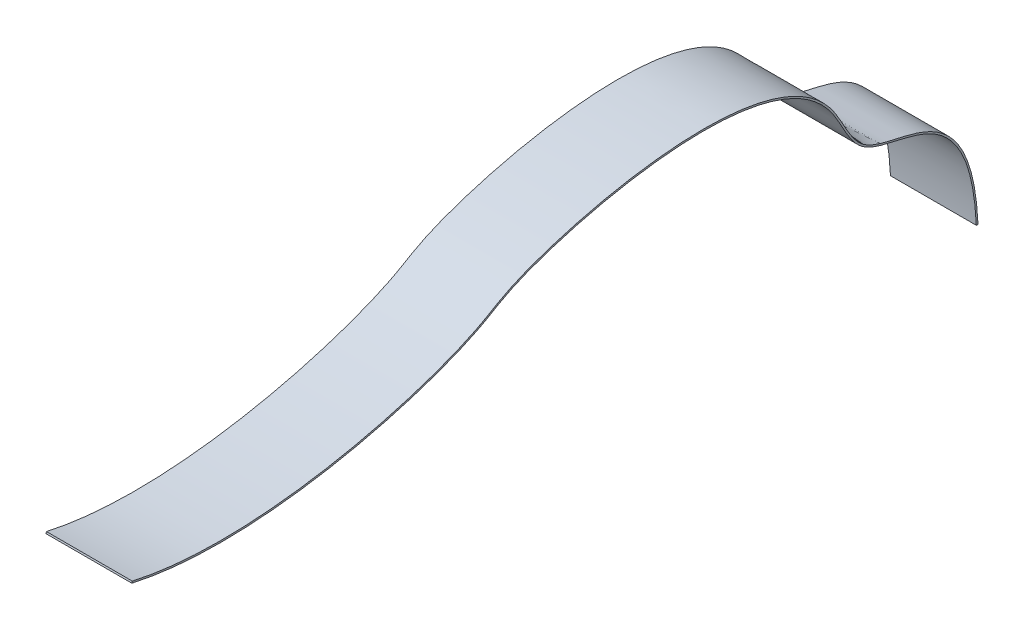
ISO-10303-21;
HEADER;
FILE_DESCRIPTION(('STEP AP214'),'2;1');
FILE_NAME('part.step','',(''),(''),'','','');
FILE_SCHEMA(('AUTOMOTIVE_DESIGN { 1 0 10303 214 1 1 1 1 }'));
ENDSEC;
DATA;
#1=APPLICATION_CONTEXT('core data for automotive mechanical design processes');
#2=APPLICATION_PROTOCOL_DEFINITION('international standard','automotive_design',2000,#1);
#3=PRODUCT_CONTEXT('',#1,'mechanical');
#4=PRODUCT('Part','Part','',(#3));
#5=PRODUCT_RELATED_PRODUCT_CATEGORY('part','',(#4));
#6=PRODUCT_DEFINITION_FORMATION('','',#4);
#7=PRODUCT_DEFINITION_CONTEXT('part definition',#1,'design');
#8=PRODUCT_DEFINITION('design','',#6,#7);
#9=PRODUCT_DEFINITION_SHAPE('','',#8);
#10=(LENGTH_UNIT() NAMED_UNIT(*) SI_UNIT(.MILLI.,.METRE.));
#11=(NAMED_UNIT(*) PLANE_ANGLE_UNIT() SI_UNIT($,.RADIAN.));
#12=(NAMED_UNIT(*) SI_UNIT($,.STERADIAN.) SOLID_ANGLE_UNIT());
#13=UNCERTAINTY_MEASURE_WITH_UNIT(LENGTH_MEASURE(1.E-05),#10,'distance_accuracy_value','');
#14=(GEOMETRIC_REPRESENTATION_CONTEXT(3) GLOBAL_UNCERTAINTY_ASSIGNED_CONTEXT((#13)) GLOBAL_UNIT_ASSIGNED_CONTEXT((#10,
#11,#12)) REPRESENTATION_CONTEXT('',''));
#15=CARTESIAN_POINT('',(0.,0.,0.));
#16=DIRECTION('',(0.,0.,1.));
#17=DIRECTION('',(1.,0.,0.));
#18=AXIS2_PLACEMENT_3D('',#15,#16,#17);
#19=CARTESIAN_POINT('',(0.,0.,0.));
#20=DIRECTION('',(0.,1.,0.));
#21=DIRECTION('',(0.,0.,1.));
#22=AXIS2_PLACEMENT_3D('',#19,#20,#21);
#23=PLANE('',#22);
#24=DIRECTION('',(0.,0.,1.));
#25=VECTOR('',#24,1.);
#26=CARTESIAN_POINT('',(-3.05,0.,-0.120000000000001));
#27=LINE('',#26,#25);
#28=CARTESIAN_POINT('',(-3.05,0.,-0.120000000000001));
#29=VERTEX_POINT('',#28);
#30=CARTESIAN_POINT('',(-3.05,0.,0.));
#31=VERTEX_POINT('',#30);
#32=EDGE_CURVE('E70',#29,#31,#27,.T.);
#33=ORIENTED_EDGE('',*,*,#32,.F.);
#34=DIRECTION('',(-1.,0.,0.));
#35=VECTOR('',#34,1.);
#36=CARTESIAN_POINT('',(-3.05,0.,-0.120000000000001));
#37=LINE('',#36,#35);
#38=CARTESIAN_POINT('',(3.05,0.,-0.120000000000001));
#39=VERTEX_POINT('',#38);
#40=EDGE_CURVE('E72',#39,#29,#37,.T.);
#41=ORIENTED_EDGE('',*,*,#40,.F.);
#42=DIRECTION('',(0.,0.,-1.));
#43=VECTOR('',#42,1.);
#44=CARTESIAN_POINT('',(3.05,0.,-0.120000000000001));
#45=LINE('',#44,#43);
#46=CARTESIAN_POINT('',(3.05,0.,0.));
#47=VERTEX_POINT('',#46);
#48=EDGE_CURVE('E86',#47,#39,#45,.T.);
#49=ORIENTED_EDGE('',*,*,#48,.F.);
#50=DIRECTION('',(1.,0.,0.));
#51=VECTOR('',#50,1.);
#52=CARTESIAN_POINT('',(-3.05,0.,0.));
#53=LINE('',#52,#51);
#54=EDGE_CURVE('E68',#31,#47,#53,.T.);
#55=ORIENTED_EDGE('',*,*,#54,.F.);
#56=EDGE_LOOP('',(#33,#41,#49,#55));
#57=FACE_BOUND('',#56,.T.);
#58=ADVANCED_FACE('F32',(#57),#23,.F.);
#59=CARTESIAN_POINT('',(0.,7.97634867030642,60.));
#60=DIRECTION('',(0.,0.266271074609221,0.963898186960869));
#61=DIRECTION('',(0.,-0.963898186960869,0.266271074609221));
#62=AXIS2_PLACEMENT_3D('',#59,#60,#61);
#63=PLANE('',#62);
#64=DIRECTION('',(0.,-0.963898186960869,0.266271074609221));
#65=VECTOR('',#64,1.);
#66=CARTESIAN_POINT('',(-3.05,8.09201645274173,59.9680474710469));
#67=LINE('',#66,#65);
#68=CARTESIAN_POINT('',(-3.05,8.09201645274173,59.9680474710469));
#69=VERTEX_POINT('',#68);
#70=CARTESIAN_POINT('',(-3.05,7.97634867030642,60.));
#71=VERTEX_POINT('',#70);
#72=EDGE_CURVE('E90',#69,#71,#67,.T.);
#73=ORIENTED_EDGE('',*,*,#72,.T.);
#74=DIRECTION('',(1.,0.,0.));
#75=VECTOR('',#74,1.);
#76=CARTESIAN_POINT('',(-3.05,7.97634867030642,60.));
#77=LINE('',#76,#75);
#78=CARTESIAN_POINT('',(3.05,7.97634867030642,60.));
#79=VERTEX_POINT('',#78);
#80=EDGE_CURVE('E158',#71,#79,#77,.T.);
#81=ORIENTED_EDGE('',*,*,#80,.T.);
#82=DIRECTION('',(0.,0.963898186960869,-0.266271074609221));
#83=VECTOR('',#82,1.);
#84=CARTESIAN_POINT('',(3.05,8.09201645274173,59.9680474710469));
#85=LINE('',#84,#83);
#86=CARTESIAN_POINT('',(3.05,8.09201645274173,59.9680474710469));
#87=VERTEX_POINT('',#86);
#88=EDGE_CURVE('E42',#79,#87,#85,.T.);
#89=ORIENTED_EDGE('',*,*,#88,.T.);
#90=DIRECTION('',(-1.,0.,0.));
#91=VECTOR('',#90,1.);
#92=CARTESIAN_POINT('',(-3.05,8.09201645274173,59.9680474710469));
#93=LINE('',#92,#91);
#94=EDGE_CURVE('E11',#87,#69,#93,.T.);
#95=ORIENTED_EDGE('',*,*,#94,.T.);
#96=EDGE_LOOP('',(#73,#81,#89,#95));
#97=FACE_BOUND('',#96,.T.);
#98=ADVANCED_FACE('F146',(#97),#63,.T.);
#99=CARTESIAN_POINT('',(-3.05,0.,-0.120000000000001));
#100=DIRECTION('',(-1.,0.,0.));
#101=DIRECTION('',(0.,0.,1.));
#102=AXIS2_PLACEMENT_3D('',#99,#100,#101);
#103=PLANE('',#102);
#104=CARTESIAN_POINT('',(-3.05,0.,0.));
#105=CARTESIAN_POINT('',(-3.05,8.48120396040808,0.389810136206408));
#106=CARTESIAN_POINT('',(-3.05,7.45861924469704,4.8196854441271));
#107=CARTESIAN_POINT('',(-3.05,8.6508489245226,7.72277395023314));
#108=CARTESIAN_POINT('',(-3.05,8.8166128288052,8.01594073097296));
#109=CARTESIAN_POINT('',(-3.05,9.25519468529611,8.52365116968327));
#110=CARTESIAN_POINT('',(-3.05,9.52339225487259,8.74126046181841));
#111=CARTESIAN_POINT('',(-3.05,10.4092525897436,9.33931371640342));
#112=CARTESIAN_POINT('',(-3.05,11.1081830978846,9.66498296081222));
#113=CARTESIAN_POINT('',(-3.05,12.057305474226,10.2597897669768));
#114=CARTESIAN_POINT('',(-3.05,12.3537037861907,10.4787823840159));
#115=CARTESIAN_POINT('',(-3.05,12.8979009484752,10.9635252047044));
#116=CARTESIAN_POINT('',(-3.05,13.1473334645292,11.2278435449592));
#117=CARTESIAN_POINT('',(-3.05,13.8316981660934,12.0796721171958));
#118=CARTESIAN_POINT('',(-3.05,14.2026974982701,12.7260559121902));
#119=CARTESIAN_POINT('',(-3.05,16.8720655116809,19.0827792837767));
#120=CARTESIAN_POINT('',(-3.05,14.4830522006781,28.5680036492555));
#121=CARTESIAN_POINT('',(-3.05,12.4827379757237,33.3273050952866));
#122=CARTESIAN_POINT('',(-3.05,12.1369678504192,33.9050643826275));
#123=CARTESIAN_POINT('',(-3.05,11.6218002696872,34.7889133199316));
#124=CARTESIAN_POINT('',(-3.05,11.4502776944944,35.0884995169633));
#125=CARTESIAN_POINT('',(-3.05,11.0966533935646,35.7821094575561));
#126=CARTESIAN_POINT('',(-3.05,10.9157630210769,36.1691506383084));
#127=CARTESIAN_POINT('',(-3.05,10.0038154099989,38.284234755494));
#128=CARTESIAN_POINT('',(-3.05,9.25027089654004,40.5519123800001));
#129=CARTESIAN_POINT('',(-3.05,7.41285936542026,48.2637482212632));
#130=CARTESIAN_POINT('',(-3.05,6.7522143439112,54.6167094357728));
#131=CARTESIAN_POINT('',(-3.05,7.97634867030642,60.));
#132=B_SPLINE_CURVE_WITH_KNOTS('',3,(#104,#105,#106,#107,#108,#109,#110,#111,#112,#113,#114,
#115,#116,#117,#118,#119,#120,#121,#122,#123,#124,#125,#126,#127,#128,#129,#130,#131),
.UNSPECIFIED.,.F.,.F.,(4,2,2,2,2,2,2,2,2,2,2,2,2,4),(0.,0.125,0.140625,0.15625,0.1875,0.203125,
0.21875,0.25,0.5,0.5625,0.59375,0.625,0.75,1.),.UNSPECIFIED.);
#133=EDGE_CURVE('E35',#31,#71,#132,.T.);
#134=ORIENTED_EDGE('',*,*,#133,.T.);
#135=ORIENTED_EDGE('',*,*,#72,.F.);
#136=CARTESIAN_POINT('',(-3.05,0.,-0.120000000000001));
#137=CARTESIAN_POINT('',(-3.05,2.35907945007418,-0.0121088808887355));
#138=CARTESIAN_POINT('',(-3.05,3.99697240192662,0.406650247024757));
#139=CARTESIAN_POINT('',(-3.05,6.31476004554354,1.63182057530954));
#140=CARTESIAN_POINT('',(-3.05,6.99137930185127,2.44124964021302));
#141=CARTESIAN_POINT('',(-3.05,7.84636709665277,4.16997760321309));
#142=CARTESIAN_POINT('',(-3.05,8.02880758755432,5.08689616191275));
#143=CARTESIAN_POINT('',(-3.05,8.31312929136114,6.34544318038815));
#144=CARTESIAN_POINT('',(-3.05,8.40952531147873,6.74556565628542));
#145=CARTESIAN_POINT('',(-3.05,8.66391444816968,7.47448943246688));
#146=CARTESIAN_POINT('',(-3.05,8.82159612107124,7.80276776708872));
#147=CARTESIAN_POINT('',(-3.05,9.3753176796599,8.51999380842043));
#148=CARTESIAN_POINT('',(-3.05,9.87200734447321,8.85557685292436));
#149=CARTESIAN_POINT('',(-3.05,10.9700654323135,9.48831825516512));
#150=CARTESIAN_POINT('',(-3.05,11.5694383421883,9.78513000931942));
#151=CARTESIAN_POINT('',(-3.05,12.8723531880958,10.691947581963));
#152=CARTESIAN_POINT('',(-3.05,13.4916110298304,11.3734605345555));
#153=CARTESIAN_POINT('',(-3.05,14.4737023304396,12.9534084108431));
#154=CARTESIAN_POINT('',(-3.05,14.8369476791241,13.8517306254131));
#155=CARTESIAN_POINT('',(-3.05,15.6106917485068,16.762658600662));
#156=CARTESIAN_POINT('',(-3.05,15.7061210328681,18.9918056711895));
#157=CARTESIAN_POINT('',(-3.05,15.3977900348541,23.4686061808669));
#158=CARTESIAN_POINT('',(-3.05,14.9934538547083,25.7163189879491));
#159=CARTESIAN_POINT('',(-3.05,14.0158971875026,29.6687946702095));
#160=CARTESIAN_POINT('',(-3.05,13.4430322561571,31.3727247252303));
#161=CARTESIAN_POINT('',(-3.05,12.6788786823213,33.157115515302));
#162=CARTESIAN_POINT('',(-3.05,12.432390149322,33.6226967323121));
#163=CARTESIAN_POINT('',(-3.05,11.9576696031105,34.4580656316045));
#164=CARTESIAN_POINT('',(-3.05,11.7301011113735,34.8271362343689));
#165=CARTESIAN_POINT('',(-3.05,10.9217987099977,36.3473339345063));
#166=CARTESIAN_POINT('',(-3.05,10.2946785699131,37.8793543411509));
#167=CARTESIAN_POINT('',(-3.05,9.12539009948058,41.5341697302077));
#168=CARTESIAN_POINT('',(-3.05,8.5827394809645,43.6575201306895));
#169=CARTESIAN_POINT('',(-3.05,7.36036086740564,50.4512367782197));
#170=CARTESIAN_POINT('',(-3.05,7.08749715075393,55.5454551092391));
#171=CARTESIAN_POINT('',(-3.05,8.09201645274173,59.9680474710469));
#172=B_SPLINE_CURVE_WITH_KNOTS('',3,(#136,#137,#138,#139,#140,#141,#142,#143,#144,#145,#146,
#147,#148,#149,#150,#151,#152,#153,#154,#155,#156,#157,#158,#159,#160,#161,#162,#163,#164,#165,
#166,#167,#168,#169,#170,#171),.UNSPECIFIED.,.F.,.F.,(4,2,2,2,2,2,2,2,2,2,2,2,2,2,2,2,2,4),(0.,
0.0346061534011105,0.069212306802221,0.103818460203331,0.121121536903887,0.138424613604442,
0.165482677346169,0.192540741087896,0.231276355948661,0.270011970809427,0.347483200530959,
0.42495443025249,0.502425659974022,0.544735403662811,0.587045147351601,0.690283860513701,
0.7935225736758,1.),.UNSPECIFIED.);
#173=EDGE_CURVE('E83',#29,#69,#172,.T.);
#174=ORIENTED_EDGE('',*,*,#173,.F.);
#175=ORIENTED_EDGE('',*,*,#32,.T.);
#176=EDGE_LOOP('',(#134,#135,#174,#175));
#177=FACE_BOUND('',#176,.T.);
#178=ADVANCED_FACE('F89',(#177),#103,.T.);
#179=CARTESIAN_POINT('',(-3.05,0.,0.));
#180=CARTESIAN_POINT('',(-3.05,2.34801475509212,0.107918634638409));
#181=CARTESIAN_POINT('',(-3.05,3.96760692345137,0.52549006052892));
#182=CARTESIAN_POINT('',(-3.05,6.2416441472875,1.73000050151414));
#183=CARTESIAN_POINT('',(-3.05,6.89608916660134,2.51693953097672));
#184=CARTESIAN_POINT('',(-3.05,7.73153011824309,4.21024717133516));
#185=CARTESIAN_POINT('',(-3.05,7.91252599196099,5.11661581202239));
#186=CARTESIAN_POINT('',(-3.05,8.19770650339806,6.37828746100801));
#187=CARTESIAN_POINT('',(-3.05,8.29504776245036,6.78253113968162));
#188=CARTESIAN_POINT('',(-3.05,8.55575478881804,7.52714913216537));
#189=CARTESIAN_POINT('',(-3.05,8.71912052060181,7.86752346277342));
#190=CARTESIAN_POINT('',(-3.05,9.30137642614317,8.61824336626388));
#191=CARTESIAN_POINT('',(-3.05,9.8124001247043,8.9598526220311));
#192=CARTESIAN_POINT('',(-3.05,10.9195996819129,9.59731213049488));
#193=CARTESIAN_POINT('',(-3.05,11.5157755862597,9.89316234375321));
#194=CARTESIAN_POINT('',(-3.05,12.7934489618364,10.7840503507918));
#195=CARTESIAN_POINT('',(-3.05,13.4007277374011,11.4531057628088));
#196=CARTESIAN_POINT('',(-3.05,14.366691523637,13.0095495054989));
#197=CARTESIAN_POINT('',(-3.05,14.725376536757,13.8969378385008));
#198=CARTESIAN_POINT('',(-3.05,15.4904805455413,16.7804494538605));
#199=CARTESIAN_POINT('',(-3.05,15.5859484964915,18.9979193768355));
#200=CARTESIAN_POINT('',(-3.05,15.2780261413134,23.456968925773));
#201=CARTESIAN_POINT('',(-3.05,14.8746358272554,25.6985485653642));
#202=CARTESIAN_POINT('',(-3.05,13.8993414452338,29.6396695863255));
#203=CARTESIAN_POINT('',(-3.05,13.3274373693272,31.3392109745254));
#204=CARTESIAN_POINT('',(-3.05,12.5683025918768,33.1102285790566));
#205=CARTESIAN_POINT('',(-3.05,12.3242906081361,33.5705321997066));
#206=CARTESIAN_POINT('',(-3.05,11.8519106891369,34.4013055978498));
#207=CARTESIAN_POINT('',(-3.05,11.623542764766,34.7717752863));
#208=CARTESIAN_POINT('',(-3.05,10.8087349334291,36.305707281009));
#209=CARTESIAN_POINT('',(-3.05,10.1802359377171,37.8428537330918));
#210=CARTESIAN_POINT('',(-3.05,9.00812158032153,41.5081408065422));
#211=CARTESIAN_POINT('',(-3.05,8.46450621602726,43.6362814156921));
#212=CARTESIAN_POINT('',(-3.05,7.23995841071608,50.446337774951));
#213=CARTESIAN_POINT('',(-3.05,6.96532424951614,55.5538880764247));
#214=CARTESIAN_POINT('',(-3.05,7.97634867030642,60.));
#215=CARTESIAN_POINT('',(3.05,0.,0.));
#216=CARTESIAN_POINT('',(3.05,2.34801475509212,0.107918634638409));
#217=CARTESIAN_POINT('',(3.05,3.96760692345137,0.52549006052892));
#218=CARTESIAN_POINT('',(3.05,6.2416441472875,1.73000050151414));
#219=CARTESIAN_POINT('',(3.05,6.89608916660134,2.51693953097672));
#220=CARTESIAN_POINT('',(3.05,7.73153011824309,4.21024717133516));
#221=CARTESIAN_POINT('',(3.05,7.91252599196099,5.11661581202239));
#222=CARTESIAN_POINT('',(3.05,8.19770650339806,6.37828746100801));
#223=CARTESIAN_POINT('',(3.05,8.29504776245036,6.78253113968162));
#224=CARTESIAN_POINT('',(3.05,8.55575478881804,7.52714913216537));
#225=CARTESIAN_POINT('',(3.05,8.71912052060181,7.86752346277342));
#226=CARTESIAN_POINT('',(3.05,9.30137642614317,8.61824336626388));
#227=CARTESIAN_POINT('',(3.05,9.8124001247043,8.9598526220311));
#228=CARTESIAN_POINT('',(3.05,10.9195996819129,9.59731213049488));
#229=CARTESIAN_POINT('',(3.05,11.5157755862597,9.89316234375321));
#230=CARTESIAN_POINT('',(3.05,12.7934489618364,10.7840503507918));
#231=CARTESIAN_POINT('',(3.05,13.4007277374011,11.4531057628088));
#232=CARTESIAN_POINT('',(3.05,14.366691523637,13.0095495054989));
#233=CARTESIAN_POINT('',(3.05,14.725376536757,13.8969378385008));
#234=CARTESIAN_POINT('',(3.05,15.4904805455413,16.7804494538605));
#235=CARTESIAN_POINT('',(3.05,15.5859484964915,18.9979193768355));
#236=CARTESIAN_POINT('',(3.05,15.2780261413134,23.456968925773));
#237=CARTESIAN_POINT('',(3.05,14.8746358272554,25.6985485653642));
#238=CARTESIAN_POINT('',(3.05,13.8993414452338,29.6396695863255));
#239=CARTESIAN_POINT('',(3.05,13.3274373693272,31.3392109745254));
#240=CARTESIAN_POINT('',(3.05,12.5683025918768,33.1102285790566));
#241=CARTESIAN_POINT('',(3.05,12.3242906081361,33.5705321997066));
#242=CARTESIAN_POINT('',(3.05,11.8519106891369,34.4013055978498));
#243=CARTESIAN_POINT('',(3.05,11.623542764766,34.7717752863));
#244=CARTESIAN_POINT('',(3.05,10.8087349334291,36.305707281009));
#245=CARTESIAN_POINT('',(3.05,10.1802359377171,37.8428537330918));
#246=CARTESIAN_POINT('',(3.05,9.00812158032153,41.5081408065422));
#247=CARTESIAN_POINT('',(3.05,8.46450621602726,43.6362814156921));
#248=CARTESIAN_POINT('',(3.05,7.23995841071608,50.446337774951));
#249=CARTESIAN_POINT('',(3.05,6.96532424951614,55.5538880764247));
#250=CARTESIAN_POINT('',(3.05,7.97634867030642,60.));
#251=B_SPLINE_SURFACE_WITH_KNOTS('',1,3,((#179,#180,#181,#182,#183,#184,#185,#186,#187,#188,
#189,#190,#191,#192,#193,#194,#195,#196,#197,#198,#199,#200,#201,#202,#203,#204,#205,#206,#207,
#208,#209,#210,#211,#212,#213,#214),(#215,#216,#217,#218,#219,#220,#221,#222,#223,#224,#225,
#226,#227,#228,#229,#230,#231,#232,#233,#234,#235,#236,#237,#238,#239,#240,#241,#242,#243,#244,
#245,#246,#247,#248,#249,#250)),.UNSPECIFIED.,.F.,.F.,.F.,(2,2),(4,2,2,2,2,2,2,2,2,2,2,2,2,2,2,
2,2,4),(0.,1.),(0.,0.0346061534011105,0.069212306802221,0.103818460203331,0.121121536903887,
0.138424613604442,0.165482677346169,0.192540741087896,0.231276355948661,0.270011970809427,
0.347483200530959,0.42495443025249,0.502425659974022,0.544735403662811,0.587045147351601,
0.690283860513701,0.7935225736758,1.),.UNSPECIFIED.);
#252=CARTESIAN_POINT('',(3.05,0.,0.));
#253=CARTESIAN_POINT('',(3.05,2.34801475509212,0.107918634638409));
#254=CARTESIAN_POINT('',(3.05,3.96760692345137,0.52549006052892));
#255=CARTESIAN_POINT('',(3.05,6.2416441472875,1.73000050151414));
#256=CARTESIAN_POINT('',(3.05,6.89608916660134,2.51693953097672));
#257=CARTESIAN_POINT('',(3.05,7.73153011824309,4.21024717133516));
#258=CARTESIAN_POINT('',(3.05,7.91252599196099,5.11661581202239));
#259=CARTESIAN_POINT('',(3.05,8.19770650339806,6.37828746100801));
#260=CARTESIAN_POINT('',(3.05,8.29504776245036,6.78253113968162));
#261=CARTESIAN_POINT('',(3.05,8.55575478881804,7.52714913216537));
#262=CARTESIAN_POINT('',(3.05,8.71912052060181,7.86752346277342));
#263=CARTESIAN_POINT('',(3.05,9.30137642614317,8.61824336626388));
#264=CARTESIAN_POINT('',(3.05,9.8124001247043,8.9598526220311));
#265=CARTESIAN_POINT('',(3.05,10.9195996819129,9.59731213049488));
#266=CARTESIAN_POINT('',(3.05,11.5157755862597,9.89316234375321));
#267=CARTESIAN_POINT('',(3.05,12.7934489618364,10.7840503507918));
#268=CARTESIAN_POINT('',(3.05,13.4007277374011,11.4531057628088));
#269=CARTESIAN_POINT('',(3.05,14.366691523637,13.0095495054989));
#270=CARTESIAN_POINT('',(3.05,14.725376536757,13.8969378385008));
#271=CARTESIAN_POINT('',(3.05,15.4904805455413,16.7804494538605));
#272=CARTESIAN_POINT('',(3.05,15.5859484964915,18.9979193768355));
#273=CARTESIAN_POINT('',(3.05,15.2780261413134,23.456968925773));
#274=CARTESIAN_POINT('',(3.05,14.8746358272554,25.6985485653642));
#275=CARTESIAN_POINT('',(3.05,13.8993414452338,29.6396695863255));
#276=CARTESIAN_POINT('',(3.05,13.3274373693272,31.3392109745254));
#277=CARTESIAN_POINT('',(3.05,12.5683025918768,33.1102285790566));
#278=CARTESIAN_POINT('',(3.05,12.3242906081361,33.5705321997066));
#279=CARTESIAN_POINT('',(3.05,11.8519106891369,34.4013055978498));
#280=CARTESIAN_POINT('',(3.05,11.623542764766,34.7717752863));
#281=CARTESIAN_POINT('',(3.05,10.8087349334291,36.305707281009));
#282=CARTESIAN_POINT('',(3.05,10.1802359377171,37.8428537330918));
#283=CARTESIAN_POINT('',(3.05,9.00812158032153,41.5081408065422));
#284=CARTESIAN_POINT('',(3.05,8.46450621602726,43.6362814156921));
#285=CARTESIAN_POINT('',(3.05,7.23995841071608,50.446337774951));
#286=CARTESIAN_POINT('',(3.05,6.96532424951614,55.5538880764247));
#287=CARTESIAN_POINT('',(3.05,7.97634867030642,60.));
#288=B_SPLINE_CURVE_WITH_KNOTS('',3,(#252,#253,#254,#255,#256,#257,#258,#259,#260,#261,#262,
#263,#264,#265,#266,#267,#268,#269,#270,#271,#272,#273,#274,#275,#276,#277,#278,#279,#280,#281,
#282,#283,#284,#285,#286,#287),.UNSPECIFIED.,.F.,.F.,(4,2,2,2,2,2,2,2,2,2,2,2,2,2,2,2,2,4),(0.,
0.0346061534011105,0.069212306802221,0.103818460203331,0.121121536903887,0.138424613604442,
0.165482677346169,0.192540741087896,0.231276355948661,0.270011970809427,0.347483200530959,
0.42495443025249,0.502425659974022,0.544735403662811,0.587045147351601,0.690283860513701,
0.7935225736758,1.),.UNSPECIFIED.);
#289=EDGE_CURVE('E92',#47,#79,#288,.T.);
#290=ORIENTED_EDGE('',*,*,#289,.T.);
#291=ORIENTED_EDGE('',*,*,#80,.F.);
#292=ORIENTED_EDGE('',*,*,#133,.F.);
#293=ORIENTED_EDGE('',*,*,#54,.T.);
#294=EDGE_LOOP('',(#290,#291,#292,#293));
#295=FACE_BOUND('',#294,.T.);
#296=ADVANCED_FACE('F138',(#295),#251,.T.);
#297=CARTESIAN_POINT('',(3.05,0.,-0.120000000000001));
#298=DIRECTION('',(-1.,0.,0.));
#299=DIRECTION('',(0.,0.,1.));
#300=AXIS2_PLACEMENT_3D('',#297,#298,#299);
#301=PLANE('',#300);
#302=CARTESIAN_POINT('',(3.05,0.,-0.120000000000001));
#303=CARTESIAN_POINT('',(3.05,2.35907945007418,-0.0121088808887355));
#304=CARTESIAN_POINT('',(3.05,3.99697240192662,0.406650247024757));
#305=CARTESIAN_POINT('',(3.05,6.31476004554354,1.63182057530954));
#306=CARTESIAN_POINT('',(3.05,6.99137930185127,2.44124964021302));
#307=CARTESIAN_POINT('',(3.05,7.84636709665277,4.16997760321309));
#308=CARTESIAN_POINT('',(3.05,8.02880758755432,5.08689616191275));
#309=CARTESIAN_POINT('',(3.05,8.31312929136114,6.34544318038815));
#310=CARTESIAN_POINT('',(3.05,8.40952531147873,6.74556565628542));
#311=CARTESIAN_POINT('',(3.05,8.66391444816968,7.47448943246688));
#312=CARTESIAN_POINT('',(3.05,8.82159612107124,7.80276776708872));
#313=CARTESIAN_POINT('',(3.05,9.3753176796599,8.51999380842043));
#314=CARTESIAN_POINT('',(3.05,9.87200734447321,8.85557685292436));
#315=CARTESIAN_POINT('',(3.05,10.9700654323135,9.48831825516512));
#316=CARTESIAN_POINT('',(3.05,11.5694383421883,9.78513000931942));
#317=CARTESIAN_POINT('',(3.05,12.8723531880958,10.691947581963));
#318=CARTESIAN_POINT('',(3.05,13.4916110298304,11.3734605345555));
#319=CARTESIAN_POINT('',(3.05,14.4737023304396,12.9534084108431));
#320=CARTESIAN_POINT('',(3.05,14.8369476791241,13.8517306254131));
#321=CARTESIAN_POINT('',(3.05,15.6106917485068,16.762658600662));
#322=CARTESIAN_POINT('',(3.05,15.7061210328681,18.9918056711895));
#323=CARTESIAN_POINT('',(3.05,15.3977900348541,23.4686061808669));
#324=CARTESIAN_POINT('',(3.05,14.9934538547083,25.7163189879491));
#325=CARTESIAN_POINT('',(3.05,14.0158971875026,29.6687946702095));
#326=CARTESIAN_POINT('',(3.05,13.4430322561571,31.3727247252303));
#327=CARTESIAN_POINT('',(3.05,12.6788786823213,33.157115515302));
#328=CARTESIAN_POINT('',(3.05,12.432390149322,33.6226967323121));
#329=CARTESIAN_POINT('',(3.05,11.9576696031105,34.4580656316045));
#330=CARTESIAN_POINT('',(3.05,11.7301011113735,34.8271362343689));
#331=CARTESIAN_POINT('',(3.05,10.9217987099977,36.3473339345063));
#332=CARTESIAN_POINT('',(3.05,10.2946785699131,37.8793543411509));
#333=CARTESIAN_POINT('',(3.05,9.12539009948058,41.5341697302077));
#334=CARTESIAN_POINT('',(3.05,8.5827394809645,43.6575201306895));
#335=CARTESIAN_POINT('',(3.05,7.36036086740564,50.4512367782197));
#336=CARTESIAN_POINT('',(3.05,7.08749715075393,55.5454551092391));
#337=CARTESIAN_POINT('',(3.05,8.09201645274173,59.9680474710469));
#338=B_SPLINE_CURVE_WITH_KNOTS('',3,(#302,#303,#304,#305,#306,#307,#308,#309,#310,#311,#312,
#313,#314,#315,#316,#317,#318,#319,#320,#321,#322,#323,#324,#325,#326,#327,#328,#329,#330,#331,
#332,#333,#334,#335,#336,#337),.UNSPECIFIED.,.F.,.F.,(4,2,2,2,2,2,2,2,2,2,2,2,2,2,2,2,2,4),(0.,
0.0346061534011105,0.069212306802221,0.103818460203331,0.121121536903887,0.138424613604442,
0.165482677346169,0.192540741087896,0.231276355948661,0.270011970809427,0.347483200530959,
0.42495443025249,0.502425659974022,0.544735403662811,0.587045147351601,0.690283860513701,
0.7935225736758,1.),.UNSPECIFIED.);
#339=EDGE_CURVE('E85',#39,#87,#338,.T.);
#340=ORIENTED_EDGE('',*,*,#339,.T.);
#341=ORIENTED_EDGE('',*,*,#88,.F.);
#342=ORIENTED_EDGE('',*,*,#289,.F.);
#343=ORIENTED_EDGE('',*,*,#48,.T.);
#344=EDGE_LOOP('',(#340,#341,#342,#343));
#345=FACE_BOUND('',#344,.T.);
#346=ADVANCED_FACE('F128',(#345),#301,.F.);
#347=CARTESIAN_POINT('',(3.05,0.,-0.120000000000001));
#348=CARTESIAN_POINT('',(3.05,2.35907945007418,-0.0121088808887355));
#349=CARTESIAN_POINT('',(3.05,3.99697240192662,0.406650247024757));
#350=CARTESIAN_POINT('',(3.05,6.31476004554354,1.63182057530954));
#351=CARTESIAN_POINT('',(3.05,6.99137930185127,2.44124964021302));
#352=CARTESIAN_POINT('',(3.05,7.84636709665277,4.16997760321309));
#353=CARTESIAN_POINT('',(3.05,8.02880758755432,5.08689616191275));
#354=CARTESIAN_POINT('',(3.05,8.31312929136114,6.34544318038815));
#355=CARTESIAN_POINT('',(3.05,8.40952531147873,6.74556565628542));
#356=CARTESIAN_POINT('',(3.05,8.66391444816968,7.47448943246688));
#357=CARTESIAN_POINT('',(3.05,8.82159612107124,7.80276776708872));
#358=CARTESIAN_POINT('',(3.05,9.3753176796599,8.51999380842043));
#359=CARTESIAN_POINT('',(3.05,9.87200734447321,8.85557685292436));
#360=CARTESIAN_POINT('',(3.05,10.9700654323135,9.48831825516512));
#361=CARTESIAN_POINT('',(3.05,11.5694383421883,9.78513000931942));
#362=CARTESIAN_POINT('',(3.05,12.8723531880958,10.691947581963));
#363=CARTESIAN_POINT('',(3.05,13.4916110298304,11.3734605345555));
#364=CARTESIAN_POINT('',(3.05,14.4737023304396,12.9534084108431));
#365=CARTESIAN_POINT('',(3.05,14.8369476791241,13.8517306254131));
#366=CARTESIAN_POINT('',(3.05,15.6106917485068,16.762658600662));
#367=CARTESIAN_POINT('',(3.05,15.7061210328681,18.9918056711895));
#368=CARTESIAN_POINT('',(3.05,15.3977900348541,23.4686061808669));
#369=CARTESIAN_POINT('',(3.05,14.9934538547083,25.7163189879491));
#370=CARTESIAN_POINT('',(3.05,14.0158971875026,29.6687946702095));
#371=CARTESIAN_POINT('',(3.05,13.4430322561571,31.3727247252303));
#372=CARTESIAN_POINT('',(3.05,12.6788786823213,33.157115515302));
#373=CARTESIAN_POINT('',(3.05,12.432390149322,33.6226967323121));
#374=CARTESIAN_POINT('',(3.05,11.9576696031105,34.4580656316045));
#375=CARTESIAN_POINT('',(3.05,11.7301011113735,34.8271362343689));
#376=CARTESIAN_POINT('',(3.05,10.9217987099977,36.3473339345063));
#377=CARTESIAN_POINT('',(3.05,10.2946785699131,37.8793543411509));
#378=CARTESIAN_POINT('',(3.05,9.12539009948058,41.5341697302077));
#379=CARTESIAN_POINT('',(3.05,8.5827394809645,43.6575201306895));
#380=CARTESIAN_POINT('',(3.05,7.36036086740564,50.4512367782197));
#381=CARTESIAN_POINT('',(3.05,7.08749715075393,55.5454551092391));
#382=CARTESIAN_POINT('',(3.05,8.09201645274173,59.9680474710469));
#383=CARTESIAN_POINT('',(-3.05,0.,-0.120000000000001));
#384=CARTESIAN_POINT('',(-3.05,2.35907945007418,-0.0121088808887355));
#385=CARTESIAN_POINT('',(-3.05,3.99697240192662,0.406650247024757));
#386=CARTESIAN_POINT('',(-3.05,6.31476004554354,1.63182057530954));
#387=CARTESIAN_POINT('',(-3.05,6.99137930185127,2.44124964021302));
#388=CARTESIAN_POINT('',(-3.05,7.84636709665277,4.16997760321309));
#389=CARTESIAN_POINT('',(-3.05,8.02880758755432,5.08689616191275));
#390=CARTESIAN_POINT('',(-3.05,8.31312929136114,6.34544318038815));
#391=CARTESIAN_POINT('',(-3.05,8.40952531147873,6.74556565628542));
#392=CARTESIAN_POINT('',(-3.05,8.66391444816968,7.47448943246688));
#393=CARTESIAN_POINT('',(-3.05,8.82159612107124,7.80276776708872));
#394=CARTESIAN_POINT('',(-3.05,9.3753176796599,8.51999380842043));
#395=CARTESIAN_POINT('',(-3.05,9.87200734447321,8.85557685292436));
#396=CARTESIAN_POINT('',(-3.05,10.9700654323135,9.48831825516512));
#397=CARTESIAN_POINT('',(-3.05,11.5694383421883,9.78513000931942));
#398=CARTESIAN_POINT('',(-3.05,12.8723531880958,10.691947581963));
#399=CARTESIAN_POINT('',(-3.05,13.4916110298304,11.3734605345555));
#400=CARTESIAN_POINT('',(-3.05,14.4737023304396,12.9534084108431));
#401=CARTESIAN_POINT('',(-3.05,14.8369476791241,13.8517306254131));
#402=CARTESIAN_POINT('',(-3.05,15.6106917485068,16.762658600662));
#403=CARTESIAN_POINT('',(-3.05,15.7061210328681,18.9918056711895));
#404=CARTESIAN_POINT('',(-3.05,15.3977900348541,23.4686061808669));
#405=CARTESIAN_POINT('',(-3.05,14.9934538547083,25.7163189879491));
#406=CARTESIAN_POINT('',(-3.05,14.0158971875026,29.6687946702095));
#407=CARTESIAN_POINT('',(-3.05,13.4430322561571,31.3727247252303));
#408=CARTESIAN_POINT('',(-3.05,12.6788786823213,33.157115515302));
#409=CARTESIAN_POINT('',(-3.05,12.432390149322,33.6226967323121));
#410=CARTESIAN_POINT('',(-3.05,11.9576696031105,34.4580656316045));
#411=CARTESIAN_POINT('',(-3.05,11.7301011113735,34.8271362343689));
#412=CARTESIAN_POINT('',(-3.05,10.9217987099977,36.3473339345063));
#413=CARTESIAN_POINT('',(-3.05,10.2946785699131,37.8793543411509));
#414=CARTESIAN_POINT('',(-3.05,9.12539009948058,41.5341697302077));
#415=CARTESIAN_POINT('',(-3.05,8.5827394809645,43.6575201306895));
#416=CARTESIAN_POINT('',(-3.05,7.36036086740564,50.4512367782197));
#417=CARTESIAN_POINT('',(-3.05,7.08749715075393,55.5454551092391));
#418=CARTESIAN_POINT('',(-3.05,8.09201645274173,59.9680474710469));
#419=B_SPLINE_SURFACE_WITH_KNOTS('',1,3,((#347,#348,#349,#350,#351,#352,#353,#354,#355,#356,
#357,#358,#359,#360,#361,#362,#363,#364,#365,#366,#367,#368,#369,#370,#371,#372,#373,#374,#375,
#376,#377,#378,#379,#380,#381,#382),(#383,#384,#385,#386,#387,#388,#389,#390,#391,#392,#393,
#394,#395,#396,#397,#398,#399,#400,#401,#402,#403,#404,#405,#406,#407,#408,#409,#410,#411,#412,
#413,#414,#415,#416,#417,#418)),.UNSPECIFIED.,.F.,.F.,.F.,(2,2),(4,2,2,2,2,2,2,2,2,2,2,2,2,2,2,
2,2,4),(0.,1.),(0.,0.0346061534011105,0.069212306802221,0.103818460203331,0.121121536903887,
0.138424613604442,0.165482677346169,0.192540741087896,0.231276355948661,0.270011970809427,
0.347483200530959,0.42495443025249,0.502425659974022,0.544735403662811,0.587045147351601,
0.690283860513701,0.7935225736758,1.),.UNSPECIFIED.);
#420=ORIENTED_EDGE('',*,*,#94,.F.);
#421=ORIENTED_EDGE('',*,*,#339,.F.);
#422=ORIENTED_EDGE('',*,*,#40,.T.);
#423=ORIENTED_EDGE('',*,*,#173,.T.);
#424=EDGE_LOOP('',(#420,#421,#422,#423));
#425=FACE_BOUND('',#424,.T.);
#426=ADVANCED_FACE('F82',(#425),#419,.T.);
#427=CLOSED_SHELL('',(#58,#98,#178,#296,#346,#426));
#428=MANIFOLD_SOLID_BREP('B2',#427);
#429=ADVANCED_BREP_SHAPE_REPRESENTATION('',(#18,#428),#14);
#430=SHAPE_DEFINITION_REPRESENTATION(#9,#429);
ENDSEC;
END-ISO-10303-21;
